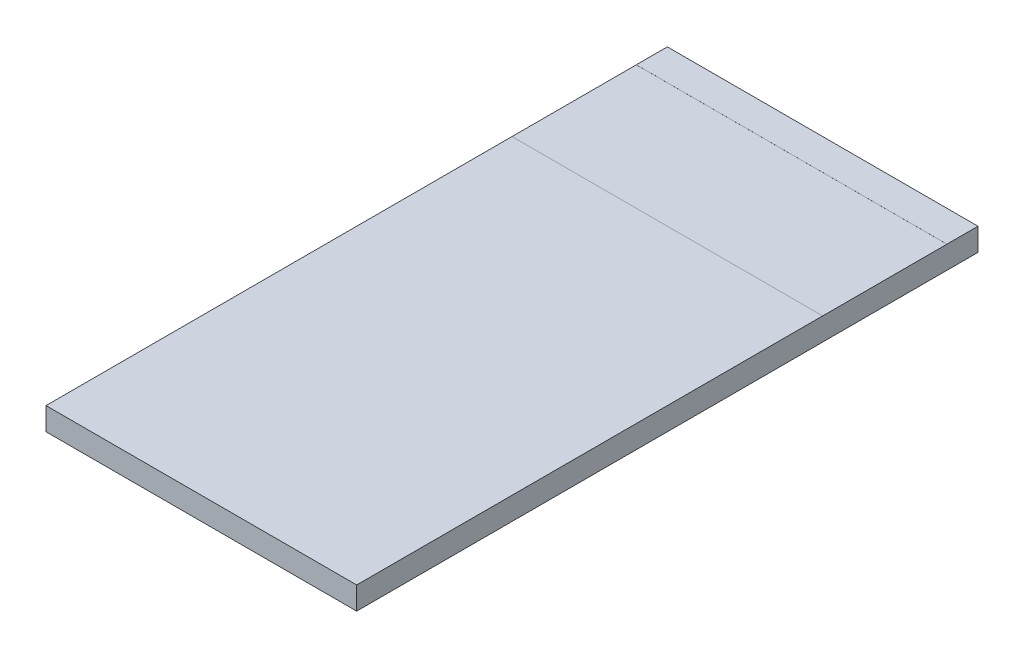
ISO-10303-21;
HEADER;
FILE_DESCRIPTION(('STEP AP214'),'2;1');
FILE_NAME('part.step','',(''),(''),'','','');
FILE_SCHEMA(('AUTOMOTIVE_DESIGN { 1 0 10303 214 1 1 1 1 }'));
ENDSEC;
DATA;
#1=APPLICATION_CONTEXT('core data for automotive mechanical design processes');
#2=APPLICATION_PROTOCOL_DEFINITION('international standard','automotive_design',2000,#1);
#3=PRODUCT_CONTEXT('',#1,'mechanical');
#4=PRODUCT('Part','Part','',(#3));
#5=PRODUCT_RELATED_PRODUCT_CATEGORY('part','',(#4));
#6=PRODUCT_DEFINITION_FORMATION('','',#4);
#7=PRODUCT_DEFINITION_CONTEXT('part definition',#1,'design');
#8=PRODUCT_DEFINITION('design','',#6,#7);
#9=PRODUCT_DEFINITION_SHAPE('','',#8);
#10=(LENGTH_UNIT() NAMED_UNIT(*) SI_UNIT(.MILLI.,.METRE.));
#11=(NAMED_UNIT(*) PLANE_ANGLE_UNIT() SI_UNIT($,.RADIAN.));
#12=(NAMED_UNIT(*) SI_UNIT($,.STERADIAN.) SOLID_ANGLE_UNIT());
#13=UNCERTAINTY_MEASURE_WITH_UNIT(LENGTH_MEASURE(1.E-05),#10,'distance_accuracy_value','');
#14=(GEOMETRIC_REPRESENTATION_CONTEXT(3) GLOBAL_UNCERTAINTY_ASSIGNED_CONTEXT((#13)) GLOBAL_UNIT_ASSIGNED_CONTEXT((#10,
#11,#12)) REPRESENTATION_CONTEXT('',''));
#15=CARTESIAN_POINT('',(0.,0.,0.));
#16=DIRECTION('',(0.,0.,1.));
#17=DIRECTION('',(1.,0.,0.));
#18=AXIS2_PLACEMENT_3D('',#15,#16,#17);
#19=CARTESIAN_POINT('',(0.,0.072865,2.));
#20=DIRECTION('',(0.,1.,0.));
#21=DIRECTION('',(0.,0.,1.));
#22=AXIS2_PLACEMENT_3D('',#19,#20,#21);
#23=PLANE('',#22);
#24=DIRECTION('',(0.,0.,-1.));
#25=VECTOR('',#24,1.);
#26=CARTESIAN_POINT('',(0.,0.072865,2.));
#27=LINE('',#26,#25);
#28=CARTESIAN_POINT('',(0.,0.072865,0.5));
#29=VERTEX_POINT('',#28);
#30=CARTESIAN_POINT('',(0.,0.072865,0.1));
#31=VERTEX_POINT('',#30);
#32=EDGE_CURVE('E43',#29,#31,#27,.T.);
#33=ORIENTED_EDGE('',*,*,#32,.F.);
#34=DIRECTION('',(-1.,0.,0.));
#35=VECTOR('',#34,1.);
#36=CARTESIAN_POINT('',(1.,0.072865,0.5));
#37=LINE('',#36,#35);
#38=CARTESIAN_POINT('',(1.,0.072865,0.5));
#39=VERTEX_POINT('',#38);
#40=EDGE_CURVE('E64',#39,#29,#37,.T.);
#41=ORIENTED_EDGE('',*,*,#40,.F.);
#42=DIRECTION('',(0.,0.,-1.));
#43=VECTOR('',#42,1.);
#44=CARTESIAN_POINT('',(1.,0.072865,2.));
#45=LINE('',#44,#43);
#46=CARTESIAN_POINT('',(1.,0.072865,0.1));
#47=VERTEX_POINT('',#46);
#48=EDGE_CURVE('E255',#39,#47,#45,.T.);
#49=ORIENTED_EDGE('',*,*,#48,.T.);
#50=DIRECTION('',(1.,0.,0.));
#51=VECTOR('',#50,1.);
#52=CARTESIAN_POINT('',(1.,0.072865,0.1));
#53=LINE('',#52,#51);
#54=EDGE_CURVE('E217',#31,#47,#53,.T.);
#55=ORIENTED_EDGE('',*,*,#54,.F.);
#56=EDGE_LOOP('',(#33,#41,#49,#55));
#57=FACE_BOUND('',#56,.T.);
#58=ADVANCED_FACE('F39',(#57),#23,.T.);
#59=CARTESIAN_POINT('',(0.,0.,2.));
#60=DIRECTION('',(-1.,0.,0.));
#61=DIRECTION('',(0.,0.,1.));
#62=AXIS2_PLACEMENT_3D('',#59,#60,#61);
#63=PLANE('',#62);
#64=DIRECTION('',(0.,1.,0.));
#65=VECTOR('',#64,1.);
#66=CARTESIAN_POINT('',(0.,0.,0.));
#67=LINE('',#66,#65);
#68=CARTESIAN_POINT('',(0.,-0.0001,0.));
#69=VERTEX_POINT('',#68);
#70=CARTESIAN_POINT('',(0.,0.072965,0.));
#71=VERTEX_POINT('',#70);
#72=EDGE_CURVE('E243',#69,#71,#67,.T.);
#73=ORIENTED_EDGE('',*,*,#72,.F.);
#74=DIRECTION('',(0.,0.,1.));
#75=VECTOR('',#74,1.);
#76=CARTESIAN_POINT('',(0.,-0.0001,0.));
#77=LINE('',#76,#75);
#78=CARTESIAN_POINT('',(0.,-0.0001,0.1));
#79=VERTEX_POINT('',#78);
#80=EDGE_CURVE('E174',#69,#79,#77,.T.);
#81=ORIENTED_EDGE('',*,*,#80,.T.);
#82=DIRECTION('',(0.,1.,0.));
#83=VECTOR('',#82,1.);
#84=CARTESIAN_POINT('',(0.,-0.0001,0.1));
#85=LINE('',#84,#83);
#86=CARTESIAN_POINT('',(0.,0.,0.1));
#87=VERTEX_POINT('',#86);
#88=EDGE_CURVE('E182',#79,#87,#85,.T.);
#89=ORIENTED_EDGE('',*,*,#88,.T.);
#90=DIRECTION('',(0.,0.,-1.));
#91=VECTOR('',#90,1.);
#92=CARTESIAN_POINT('',(0.,0.,2.));
#93=LINE('',#92,#91);
#94=CARTESIAN_POINT('',(0.,0.,0.5));
#95=VERTEX_POINT('',#94);
#96=EDGE_CURVE('E11',#95,#87,#93,.T.);
#97=ORIENTED_EDGE('',*,*,#96,.F.);
#98=DIRECTION('',(0.,1.,0.));
#99=VECTOR('',#98,1.);
#100=CARTESIAN_POINT('',(0.,-0.0001,0.5));
#101=LINE('',#100,#99);
#102=CARTESIAN_POINT('',(0.,-0.0001,0.5));
#103=VERTEX_POINT('',#102);
#104=EDGE_CURVE('E137',#103,#95,#101,.T.);
#105=ORIENTED_EDGE('',*,*,#104,.F.);
#106=DIRECTION('',(0.,0.,1.));
#107=VECTOR('',#106,1.);
#108=CARTESIAN_POINT('',(0.,-0.0001,0.5));
#109=LINE('',#108,#107);
#110=CARTESIAN_POINT('',(0.,-0.0001,2.));
#111=VERTEX_POINT('',#110);
#112=EDGE_CURVE('E148',#103,#111,#109,.T.);
#113=ORIENTED_EDGE('',*,*,#112,.T.);
#114=DIRECTION('',(0.,1.,0.));
#115=VECTOR('',#114,1.);
#116=CARTESIAN_POINT('',(0.,0.,2.));
#117=LINE('',#116,#115);
#118=CARTESIAN_POINT('',(0.,0.072965,2.));
#119=VERTEX_POINT('',#118);
#120=EDGE_CURVE('E244',#111,#119,#117,.T.);
#121=ORIENTED_EDGE('',*,*,#120,.T.);
#122=DIRECTION('',(0.,0.,1.));
#123=VECTOR('',#122,1.);
#124=CARTESIAN_POINT('',(0.,0.072965,0.5));
#125=LINE('',#124,#123);
#126=CARTESIAN_POINT('',(0.,0.072965,0.5));
#127=VERTEX_POINT('',#126);
#128=EDGE_CURVE('E199',#127,#119,#125,.T.);
#129=ORIENTED_EDGE('',*,*,#128,.F.);
#130=DIRECTION('',(0.,-1.,0.));
#131=VECTOR('',#130,1.);
#132=CARTESIAN_POINT('',(0.,0.072965,0.5));
#133=LINE('',#132,#131);
#134=EDGE_CURVE('E207',#127,#29,#133,.T.);
#135=ORIENTED_EDGE('',*,*,#134,.T.);
#136=ORIENTED_EDGE('',*,*,#32,.T.);
#137=DIRECTION('',(0.,-1.,0.));
#138=VECTOR('',#137,1.);
#139=CARTESIAN_POINT('',(0.,0.072965,0.1));
#140=LINE('',#139,#138);
#141=CARTESIAN_POINT('',(0.,0.072965,0.1));
#142=VERTEX_POINT('',#141);
#143=EDGE_CURVE('E239',#142,#31,#140,.T.);
#144=ORIENTED_EDGE('',*,*,#143,.F.);
#145=DIRECTION('',(0.,0.,1.));
#146=VECTOR('',#145,1.);
#147=CARTESIAN_POINT('',(0.,0.072965,0.));
#148=LINE('',#147,#146);
#149=EDGE_CURVE('E226',#71,#142,#148,.T.);
#150=ORIENTED_EDGE('',*,*,#149,.F.);
#151=EDGE_LOOP('',(#73,#81,#89,#97,#105,#113,#121,#129,#135,#136,#144,#150));
#152=FACE_BOUND('',#151,.T.);
#153=ADVANCED_FACE('F41',(#152),#63,.T.);
#154=CARTESIAN_POINT('',(0.,0.,2.));
#155=DIRECTION('',(0.,1.,0.));
#156=DIRECTION('',(0.,0.,1.));
#157=AXIS2_PLACEMENT_3D('',#154,#155,#156);
#158=PLANE('',#157);
#159=DIRECTION('',(0.,0.,-1.));
#160=VECTOR('',#159,1.);
#161=CARTESIAN_POINT('',(1.,0.,2.));
#162=LINE('',#161,#160);
#163=CARTESIAN_POINT('',(1.,0.,0.5));
#164=VERTEX_POINT('',#163);
#165=CARTESIAN_POINT('',(1.,0.,0.1));
#166=VERTEX_POINT('',#165);
#167=EDGE_CURVE('E49',#164,#166,#162,.T.);
#168=ORIENTED_EDGE('',*,*,#167,.F.);
#169=DIRECTION('',(-1.,0.,0.));
#170=VECTOR('',#169,1.);
#171=CARTESIAN_POINT('',(1.,0.,0.5));
#172=LINE('',#171,#170);
#173=EDGE_CURVE('E134',#164,#95,#172,.T.);
#174=ORIENTED_EDGE('',*,*,#173,.T.);
#175=ORIENTED_EDGE('',*,*,#96,.T.);
#176=DIRECTION('',(1.,0.,0.));
#177=VECTOR('',#176,1.);
#178=CARTESIAN_POINT('',(1.,0.,0.1));
#179=LINE('',#178,#177);
#180=EDGE_CURVE('E164',#87,#166,#179,.T.);
#181=ORIENTED_EDGE('',*,*,#180,.T.);
#182=EDGE_LOOP('',(#168,#174,#175,#181));
#183=FACE_BOUND('',#182,.T.);
#184=ADVANCED_FACE('F285',(#183),#158,.F.);
#185=CARTESIAN_POINT('',(1.,0.,2.));
#186=DIRECTION('',(-1.,0.,0.));
#187=DIRECTION('',(0.,0.,1.));
#188=AXIS2_PLACEMENT_3D('',#185,#186,#187);
#189=PLANE('',#188);
#190=DIRECTION('',(0.,1.,0.));
#191=VECTOR('',#190,1.);
#192=CARTESIAN_POINT('',(1.,0.,0.));
#193=LINE('',#192,#191);
#194=CARTESIAN_POINT('',(1.,-0.0001,0.));
#195=VERTEX_POINT('',#194);
#196=CARTESIAN_POINT('',(1.,0.072965,0.));
#197=VERTEX_POINT('',#196);
#198=EDGE_CURVE('E247',#195,#197,#193,.T.);
#199=ORIENTED_EDGE('',*,*,#198,.T.);
#200=DIRECTION('',(0.,0.,-1.));
#201=VECTOR('',#200,1.);
#202=CARTESIAN_POINT('',(1.,0.072965,0.));
#203=LINE('',#202,#201);
#204=CARTESIAN_POINT('',(1.,0.072965,0.1));
#205=VERTEX_POINT('',#204);
#206=EDGE_CURVE('E218',#205,#197,#203,.T.);
#207=ORIENTED_EDGE('',*,*,#206,.F.);
#208=DIRECTION('',(0.,-1.,0.));
#209=VECTOR('',#208,1.);
#210=CARTESIAN_POINT('',(1.,0.072965,0.1));
#211=LINE('',#210,#209);
#212=EDGE_CURVE('E232',#205,#47,#211,.T.);
#213=ORIENTED_EDGE('',*,*,#212,.T.);
#214=ORIENTED_EDGE('',*,*,#48,.F.);
#215=DIRECTION('',(0.,-1.,0.));
#216=VECTOR('',#215,1.);
#217=CARTESIAN_POINT('',(1.,0.072965,0.5));
#218=LINE('',#217,#216);
#219=CARTESIAN_POINT('',(1.,0.072965,0.5));
#220=VERTEX_POINT('',#219);
#221=EDGE_CURVE('E213',#220,#39,#218,.T.);
#222=ORIENTED_EDGE('',*,*,#221,.F.);
#223=DIRECTION('',(0.,0.,-1.));
#224=VECTOR('',#223,1.);
#225=CARTESIAN_POINT('',(1.,0.072965,0.5));
#226=LINE('',#225,#224);
#227=CARTESIAN_POINT('',(1.,0.072965,2.));
#228=VERTEX_POINT('',#227);
#229=EDGE_CURVE('E192',#228,#220,#226,.T.);
#230=ORIENTED_EDGE('',*,*,#229,.F.);
#231=DIRECTION('',(0.,1.,0.));
#232=VECTOR('',#231,1.);
#233=CARTESIAN_POINT('',(1.,0.,2.));
#234=LINE('',#233,#232);
#235=CARTESIAN_POINT('',(1.,-0.0001,2.));
#236=VERTEX_POINT('',#235);
#237=EDGE_CURVE('E153',#236,#228,#234,.T.);
#238=ORIENTED_EDGE('',*,*,#237,.F.);
#239=DIRECTION('',(0.,0.,-1.));
#240=VECTOR('',#239,1.);
#241=CARTESIAN_POINT('',(1.,-0.0001,0.5));
#242=LINE('',#241,#240);
#243=CARTESIAN_POINT('',(1.,-0.0001,0.5));
#244=VERTEX_POINT('',#243);
#245=EDGE_CURVE('E145',#236,#244,#242,.T.);
#246=ORIENTED_EDGE('',*,*,#245,.T.);
#247=DIRECTION('',(0.,1.,0.));
#248=VECTOR('',#247,1.);
#249=CARTESIAN_POINT('',(1.,-0.0001,0.5));
#250=LINE('',#249,#248);
#251=EDGE_CURVE('E129',#244,#164,#250,.T.);
#252=ORIENTED_EDGE('',*,*,#251,.T.);
#253=ORIENTED_EDGE('',*,*,#167,.T.);
#254=DIRECTION('',(0.,1.,0.));
#255=VECTOR('',#254,1.);
#256=CARTESIAN_POINT('',(1.,-0.0001,0.1));
#257=LINE('',#256,#255);
#258=CARTESIAN_POINT('',(1.,-0.0001,0.1));
#259=VERTEX_POINT('',#258);
#260=EDGE_CURVE('E186',#259,#166,#257,.T.);
#261=ORIENTED_EDGE('',*,*,#260,.F.);
#262=DIRECTION('',(0.,0.,-1.));
#263=VECTOR('',#262,1.);
#264=CARTESIAN_POINT('',(1.,-0.0001,0.));
#265=LINE('',#264,#263);
#266=EDGE_CURVE('E166',#259,#195,#265,.T.);
#267=ORIENTED_EDGE('',*,*,#266,.T.);
#268=EDGE_LOOP('',(#199,#207,#213,#214,#222,#230,#238,#246,#252,#253,#261,#267));
#269=FACE_BOUND('',#268,.T.);
#270=ADVANCED_FACE('F151',(#269),#189,.F.);
#271=CARTESIAN_POINT('',(0.,0.,2.));
#272=DIRECTION('',(0.,0.,-1.));
#273=DIRECTION('',(-1.,0.,0.));
#274=AXIS2_PLACEMENT_3D('',#271,#272,#273);
#275=PLANE('',#274);
#276=ORIENTED_EDGE('',*,*,#120,.F.);
#277=DIRECTION('',(1.,0.,0.));
#278=VECTOR('',#277,1.);
#279=CARTESIAN_POINT('',(1.,-0.0001,2.));
#280=LINE('',#279,#278);
#281=EDGE_CURVE('E138',#111,#236,#280,.T.);
#282=ORIENTED_EDGE('',*,*,#281,.T.);
#283=ORIENTED_EDGE('',*,*,#237,.T.);
#284=DIRECTION('',(1.,0.,0.));
#285=VECTOR('',#284,1.);
#286=CARTESIAN_POINT('',(1.,0.072965,2.));
#287=LINE('',#286,#285);
#288=EDGE_CURVE('E203',#119,#228,#287,.T.);
#289=ORIENTED_EDGE('',*,*,#288,.F.);
#290=EDGE_LOOP('',(#276,#282,#283,#289));
#291=FACE_BOUND('',#290,.T.);
#292=ADVANCED_FACE('F292',(#291),#275,.F.);
#293=CARTESIAN_POINT('',(0.,0.,0.));
#294=DIRECTION('',(0.,0.,-1.));
#295=DIRECTION('',(-1.,0.,0.));
#296=AXIS2_PLACEMENT_3D('',#293,#294,#295);
#297=PLANE('',#296);
#298=ORIENTED_EDGE('',*,*,#72,.T.);
#299=DIRECTION('',(-1.,0.,0.));
#300=VECTOR('',#299,1.);
#301=CARTESIAN_POINT('',(1.,0.072965,0.));
#302=LINE('',#301,#300);
#303=EDGE_CURVE('E222',#197,#71,#302,.T.);
#304=ORIENTED_EDGE('',*,*,#303,.F.);
#305=ORIENTED_EDGE('',*,*,#198,.F.);
#306=DIRECTION('',(-1.,0.,0.));
#307=VECTOR('',#306,1.);
#308=CARTESIAN_POINT('',(1.,-0.0001,0.));
#309=LINE('',#308,#307);
#310=EDGE_CURVE('E170',#195,#69,#309,.T.);
#311=ORIENTED_EDGE('',*,*,#310,.T.);
#312=EDGE_LOOP('',(#298,#304,#305,#311));
#313=FACE_BOUND('',#312,.T.);
#314=ADVANCED_FACE('F279',(#313),#297,.T.);
#315=CARTESIAN_POINT('',(1.,0.072965,0.1));
#316=DIRECTION('',(0.,0.,-1.));
#317=DIRECTION('',(-1.,0.,0.));
#318=AXIS2_PLACEMENT_3D('',#315,#316,#317);
#319=PLANE('',#318);
#320=ORIENTED_EDGE('',*,*,#54,.T.);
#321=ORIENTED_EDGE('',*,*,#212,.F.);
#322=DIRECTION('',(1.,0.,0.));
#323=VECTOR('',#322,1.);
#324=CARTESIAN_POINT('',(1.,0.072965,0.1));
#325=LINE('',#324,#323);
#326=EDGE_CURVE('E229',#142,#205,#325,.T.);
#327=ORIENTED_EDGE('',*,*,#326,.F.);
#328=ORIENTED_EDGE('',*,*,#143,.T.);
#329=EDGE_LOOP('',(#320,#321,#327,#328));
#330=FACE_BOUND('',#329,.T.);
#331=ADVANCED_FACE('F267',(#330),#319,.F.);
#332=CARTESIAN_POINT('',(0.,0.072965,0.));
#333=DIRECTION('',(0.,-1.,0.));
#334=DIRECTION('',(0.,0.,-1.));
#335=AXIS2_PLACEMENT_3D('',#332,#333,#334);
#336=PLANE('',#335);
#337=ORIENTED_EDGE('',*,*,#206,.T.);
#338=ORIENTED_EDGE('',*,*,#303,.T.);
#339=ORIENTED_EDGE('',*,*,#149,.T.);
#340=ORIENTED_EDGE('',*,*,#326,.T.);
#341=EDGE_LOOP('',(#337,#338,#339,#340));
#342=FACE_BOUND('',#341,.T.);
#343=ADVANCED_FACE('F270',(#342),#336,.F.);
#344=CARTESIAN_POINT('',(1.,0.072965,0.5));
#345=DIRECTION('',(0.,0.,1.));
#346=DIRECTION('',(1.,0.,0.));
#347=AXIS2_PLACEMENT_3D('',#344,#345,#346);
#348=PLANE('',#347);
#349=ORIENTED_EDGE('',*,*,#40,.T.);
#350=ORIENTED_EDGE('',*,*,#134,.F.);
#351=DIRECTION('',(-1.,0.,0.));
#352=VECTOR('',#351,1.);
#353=CARTESIAN_POINT('',(1.,0.072965,0.5));
#354=LINE('',#353,#352);
#355=EDGE_CURVE('E196',#220,#127,#354,.T.);
#356=ORIENTED_EDGE('',*,*,#355,.F.);
#357=ORIENTED_EDGE('',*,*,#221,.T.);
#358=EDGE_LOOP('',(#349,#350,#356,#357));
#359=FACE_BOUND('',#358,.T.);
#360=ADVANCED_FACE('F380',(#359),#348,.F.);
#361=CARTESIAN_POINT('',(0.,0.072965,0.));
#362=DIRECTION('',(0.,-1.,0.));
#363=DIRECTION('',(0.,0.,-1.));
#364=AXIS2_PLACEMENT_3D('',#361,#362,#363);
#365=PLANE('',#364);
#366=ORIENTED_EDGE('',*,*,#229,.T.);
#367=ORIENTED_EDGE('',*,*,#355,.T.);
#368=ORIENTED_EDGE('',*,*,#128,.T.);
#369=ORIENTED_EDGE('',*,*,#288,.T.);
#370=EDGE_LOOP('',(#366,#367,#368,#369));
#371=FACE_BOUND('',#370,.T.);
#372=ADVANCED_FACE('F310',(#371),#365,.F.);
#373=CARTESIAN_POINT('',(1.,-0.0001,0.1));
#374=DIRECTION('',(0.,0.,1.));
#375=DIRECTION('',(1.,0.,0.));
#376=AXIS2_PLACEMENT_3D('',#373,#374,#375);
#377=PLANE('',#376);
#378=ORIENTED_EDGE('',*,*,#180,.F.);
#379=ORIENTED_EDGE('',*,*,#88,.F.);
#380=DIRECTION('',(1.,0.,0.));
#381=VECTOR('',#380,1.);
#382=CARTESIAN_POINT('',(1.,-0.0001,0.1));
#383=LINE('',#382,#381);
#384=EDGE_CURVE('E178',#79,#259,#383,.T.);
#385=ORIENTED_EDGE('',*,*,#384,.T.);
#386=ORIENTED_EDGE('',*,*,#260,.T.);
#387=EDGE_LOOP('',(#378,#379,#385,#386));
#388=FACE_BOUND('',#387,.T.);
#389=ADVANCED_FACE('F282',(#388),#377,.T.);
#390=CARTESIAN_POINT('',(0.,-0.0001,0.));
#391=DIRECTION('',(0.,-1.,0.));
#392=DIRECTION('',(0.,0.,-1.));
#393=AXIS2_PLACEMENT_3D('',#390,#391,#392);
#394=PLANE('',#393);
#395=ORIENTED_EDGE('',*,*,#266,.F.);
#396=ORIENTED_EDGE('',*,*,#384,.F.);
#397=ORIENTED_EDGE('',*,*,#80,.F.);
#398=ORIENTED_EDGE('',*,*,#310,.F.);
#399=EDGE_LOOP('',(#395,#396,#397,#398));
#400=FACE_BOUND('',#399,.T.);
#401=ADVANCED_FACE('F278',(#400),#394,.T.);
#402=CARTESIAN_POINT('',(1.,-0.0001,0.5));
#403=DIRECTION('',(0.,0.,-1.));
#404=DIRECTION('',(-1.,0.,0.));
#405=AXIS2_PLACEMENT_3D('',#402,#403,#404);
#406=PLANE('',#405);
#407=ORIENTED_EDGE('',*,*,#173,.F.);
#408=ORIENTED_EDGE('',*,*,#251,.F.);
#409=DIRECTION('',(-1.,0.,0.));
#410=VECTOR('',#409,1.);
#411=CARTESIAN_POINT('',(1.,-0.0001,0.5));
#412=LINE('',#411,#410);
#413=EDGE_CURVE('E132',#244,#103,#412,.T.);
#414=ORIENTED_EDGE('',*,*,#413,.T.);
#415=ORIENTED_EDGE('',*,*,#104,.T.);
#416=EDGE_LOOP('',(#407,#408,#414,#415));
#417=FACE_BOUND('',#416,.T.);
#418=ADVANCED_FACE('F131',(#417),#406,.T.);
#419=CARTESIAN_POINT('',(0.,-0.0001,0.));
#420=DIRECTION('',(0.,-1.,0.));
#421=DIRECTION('',(0.,0.,-1.));
#422=AXIS2_PLACEMENT_3D('',#419,#420,#421);
#423=PLANE('',#422);
#424=ORIENTED_EDGE('',*,*,#245,.F.);
#425=ORIENTED_EDGE('',*,*,#281,.F.);
#426=ORIENTED_EDGE('',*,*,#112,.F.);
#427=ORIENTED_EDGE('',*,*,#413,.F.);
#428=EDGE_LOOP('',(#424,#425,#426,#427));
#429=FACE_BOUND('',#428,.T.);
#430=ADVANCED_FACE('F143',(#429),#423,.T.);
#431=CLOSED_SHELL('',(#58,#153,#184,#270,#292,#314,#331,#343,#360,#372,#389,#401,#418,#430));
#432=MANIFOLD_SOLID_BREP('B2',#431);
#433=ADVANCED_BREP_SHAPE_REPRESENTATION('',(#18,#432),#14);
#434=SHAPE_DEFINITION_REPRESENTATION(#9,#433);
ENDSEC;
END-ISO-10303-21;
